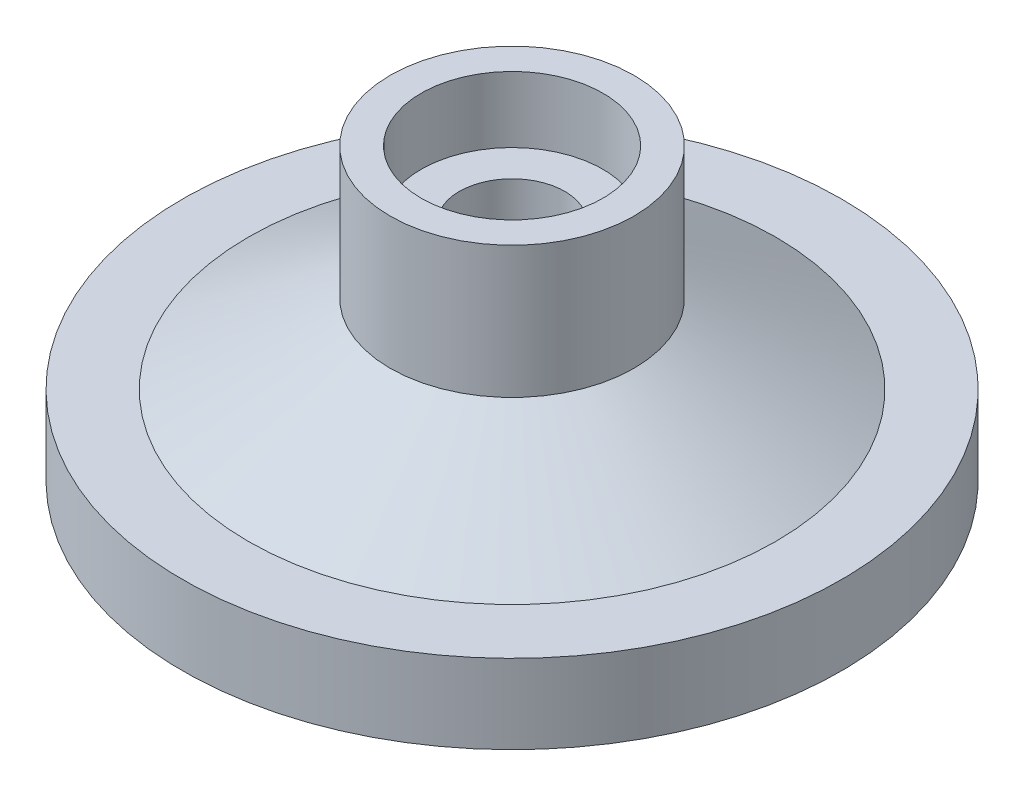
ISO-10303-21;
HEADER;
FILE_DESCRIPTION(('STEP AP214'),'2;1');
FILE_NAME('part.step','',(''),(''),'','','');
FILE_SCHEMA(('AUTOMOTIVE_DESIGN { 1 0 10303 214 1 1 1 1 }'));
ENDSEC;
DATA;
#1=APPLICATION_CONTEXT('core data for automotive mechanical design processes');
#2=APPLICATION_PROTOCOL_DEFINITION('international standard','automotive_design',2000,#1);
#3=PRODUCT_CONTEXT('',#1,'mechanical');
#4=PRODUCT('Part','Part','',(#3));
#5=PRODUCT_RELATED_PRODUCT_CATEGORY('part','',(#4));
#6=PRODUCT_DEFINITION_FORMATION('','',#4);
#7=PRODUCT_DEFINITION_CONTEXT('part definition',#1,'design');
#8=PRODUCT_DEFINITION('design','',#6,#7);
#9=PRODUCT_DEFINITION_SHAPE('','',#8);
#10=(LENGTH_UNIT() NAMED_UNIT(*) SI_UNIT(.MILLI.,.METRE.));
#11=(NAMED_UNIT(*) PLANE_ANGLE_UNIT() SI_UNIT($,.RADIAN.));
#12=(NAMED_UNIT(*) SI_UNIT($,.STERADIAN.) SOLID_ANGLE_UNIT());
#13=UNCERTAINTY_MEASURE_WITH_UNIT(LENGTH_MEASURE(1.E-05),#10,'distance_accuracy_value','');
#14=(GEOMETRIC_REPRESENTATION_CONTEXT(3) GLOBAL_UNCERTAINTY_ASSIGNED_CONTEXT((#13)) GLOBAL_UNIT_ASSIGNED_CONTEXT((#10,
#11,#12)) REPRESENTATION_CONTEXT('',''));
#15=CARTESIAN_POINT('',(0.,0.,0.));
#16=DIRECTION('',(0.,0.,1.));
#17=DIRECTION('',(1.,0.,0.));
#18=AXIS2_PLACEMENT_3D('',#15,#16,#17);
#19=CARTESIAN_POINT('',(0.,26.,0.));
#20=DIRECTION('',(0.,-1.,0.));
#21=DIRECTION('',(0.,0.,-1.));
#22=AXIS2_PLACEMENT_3D('',#19,#20,#21);
#23=CYLINDRICAL_SURFACE('',#22,4.);
#24=CARTESIAN_POINT('',(0.,6.,0.));
#25=DIRECTION('',(0.,-1.,0.));
#26=DIRECTION('',(0.,0.,-1.));
#27=AXIS2_PLACEMENT_3D('',#24,#25,#26);
#28=CIRCLE('',#27,4.);
#29=CARTESIAN_POINT('',(-3.99974418258074,6.,0.0452379697986311));
#30=VERTEX_POINT('',#29);
#31=EDGE_CURVE('E63',#30,#30,#28,.T.);
#32=ORIENTED_EDGE('',*,*,#31,.T.);
#33=EDGE_LOOP('',(#32));
#34=FACE_BOUND('',#33,.T.);
#35=CARTESIAN_POINT('',(0.,17.,0.));
#36=DIRECTION('',(0.,1.,0.));
#37=DIRECTION('',(0.,0.,1.));
#38=AXIS2_PLACEMENT_3D('',#35,#36,#37);
#39=CIRCLE('',#38,4.);
#40=CARTESIAN_POINT('',(0.,17.,4.));
#41=VERTEX_POINT('',#40);
#42=EDGE_CURVE('E42',#41,#41,#39,.F.);
#43=ORIENTED_EDGE('',*,*,#42,.F.);
#44=EDGE_LOOP('',(#43));
#45=FACE_BOUND('',#44,.T.);
#46=ADVANCED_FACE('F37',(#34,#45),#23,.F.);
#47=CARTESIAN_POINT('',(25.,0.,0.));
#48=DIRECTION('',(0.,-1.,0.));
#49=DIRECTION('',(0.,0.,-1.));
#50=AXIS2_PLACEMENT_3D('',#47,#48,#49);
#51=PLANE('',#50);
#52=CARTESIAN_POINT('',(0.,0.,0.));
#53=DIRECTION('',(0.,-1.,0.));
#54=DIRECTION('',(0.,0.,-1.));
#55=AXIS2_PLACEMENT_3D('',#52,#53,#54);
#56=CIRCLE('',#55,22.);
#57=CARTESIAN_POINT('',(0.,0.,-22.));
#58=VERTEX_POINT('',#57);
#59=EDGE_CURVE('E59',#58,#58,#56,.T.);
#60=ORIENTED_EDGE('',*,*,#59,.F.);
#61=EDGE_LOOP('',(#60));
#62=FACE_BOUND('',#61,.T.);
#63=CARTESIAN_POINT('',(0.,0.,0.));
#64=DIRECTION('',(0.,-1.,0.));
#65=DIRECTION('',(0.,0.,-1.));
#66=AXIS2_PLACEMENT_3D('',#63,#64,#65);
#67=CIRCLE('',#66,25.);
#68=CARTESIAN_POINT('',(0.,0.,-25.));
#69=VERTEX_POINT('',#68);
#70=EDGE_CURVE('E11',#69,#69,#67,.T.);
#71=ORIENTED_EDGE('',*,*,#70,.T.);
#72=EDGE_LOOP('',(#71));
#73=FACE_BOUND('',#72,.T.);
#74=ADVANCED_FACE('F39',(#62,#73),#51,.T.);
#75=CARTESIAN_POINT('',(0.,0.,0.));
#76=DIRECTION('',(0.,-1.,0.));
#77=DIRECTION('',(0.,0.,-1.));
#78=AXIS2_PLACEMENT_3D('',#75,#76,#77);
#79=CYLINDRICAL_SURFACE('',#78,25.);
#80=CARTESIAN_POINT('',(0.,6.,0.));
#81=DIRECTION('',(0.,-1.,0.));
#82=DIRECTION('',(0.,0.,-1.));
#83=AXIS2_PLACEMENT_3D('',#80,#81,#82);
#84=CIRCLE('',#83,25.);
#85=CARTESIAN_POINT('',(0.,6.,-25.));
#86=VERTEX_POINT('',#85);
#87=EDGE_CURVE('E46',#86,#86,#84,.T.);
#88=ORIENTED_EDGE('',*,*,#87,.T.);
#89=EDGE_LOOP('',(#88));
#90=FACE_BOUND('',#89,.T.);
#91=ORIENTED_EDGE('',*,*,#70,.F.);
#92=EDGE_LOOP('',(#91));
#93=FACE_BOUND('',#92,.T.);
#94=ADVANCED_FACE('F161',(#90,#93),#79,.T.);
#95=CARTESIAN_POINT('',(25.,6.,0.));
#96=DIRECTION('',(0.,1.,0.));
#97=DIRECTION('',(0.,0.,1.));
#98=AXIS2_PLACEMENT_3D('',#95,#96,#97);
#99=PLANE('',#98);
#100=CARTESIAN_POINT('',(0.,6.,0.));
#101=DIRECTION('',(0.,-1.,0.));
#102=DIRECTION('',(0.,0.,-1.));
#103=AXIS2_PLACEMENT_3D('',#100,#101,#102);
#104=CIRCLE('',#103,20.);
#105=CARTESIAN_POINT('',(0.,6.,-20.));
#106=VERTEX_POINT('',#105);
#107=EDGE_CURVE('E51',#106,#106,#104,.T.);
#108=ORIENTED_EDGE('',*,*,#107,.T.);
#109=EDGE_LOOP('',(#108));
#110=FACE_BOUND('',#109,.T.);
#111=ORIENTED_EDGE('',*,*,#87,.F.);
#112=EDGE_LOOP('',(#111));
#113=FACE_BOUND('',#112,.T.);
#114=ADVANCED_FACE('F148',(#110,#113),#99,.T.);
#115=CARTESIAN_POINT('',(0.,6.,0.));
#116=DIRECTION('',(0.,-1.,0.));
#117=DIRECTION('',(0.,0.,-1.));
#118=AXIS2_PLACEMENT_3D('',#115,#116,#117);
#119=CONICAL_SURFACE('',#118,20.,1.06172543837251);
#120=CARTESIAN_POINT('',(0.,12.,0.));
#121=DIRECTION('',(0.,-1.,0.));
#122=DIRECTION('',(0.,0.,-1.));
#123=AXIS2_PLACEMENT_3D('',#120,#121,#122);
#124=CIRCLE('',#123,9.25);
#125=CARTESIAN_POINT('',(0.,12.,-9.25));
#126=VERTEX_POINT('',#125);
#127=EDGE_CURVE('E143',#126,#126,#124,.T.);
#128=ORIENTED_EDGE('',*,*,#127,.T.);
#129=EDGE_LOOP('',(#128));
#130=FACE_BOUND('',#129,.T.);
#131=ORIENTED_EDGE('',*,*,#107,.F.);
#132=EDGE_LOOP('',(#131));
#133=FACE_BOUND('',#132,.T.);
#134=ADVANCED_FACE('F151',(#130,#133),#119,.T.);
#135=CARTESIAN_POINT('',(0.,0.,0.));
#136=DIRECTION('',(0.,-1.,0.));
#137=DIRECTION('',(0.,0.,-1.));
#138=AXIS2_PLACEMENT_3D('',#135,#136,#137);
#139=CYLINDRICAL_SURFACE('',#138,9.25);
#140=CARTESIAN_POINT('',(0.,22.,0.));
#141=DIRECTION('',(0.,-1.,0.));
#142=DIRECTION('',(0.,0.,-1.));
#143=AXIS2_PLACEMENT_3D('',#140,#141,#142);
#144=CIRCLE('',#143,9.25);
#145=CARTESIAN_POINT('',(0.,22.,-9.25));
#146=VERTEX_POINT('',#145);
#147=EDGE_CURVE('E138',#146,#146,#144,.T.);
#148=ORIENTED_EDGE('',*,*,#147,.T.);
#149=EDGE_LOOP('',(#148));
#150=FACE_BOUND('',#149,.T.);
#151=ORIENTED_EDGE('',*,*,#127,.F.);
#152=EDGE_LOOP('',(#151));
#153=FACE_BOUND('',#152,.T.);
#154=ADVANCED_FACE('F153',(#150,#153),#139,.T.);
#155=CARTESIAN_POINT('',(9.25,22.,0.));
#156=DIRECTION('',(0.,1.,0.));
#157=DIRECTION('',(0.,0.,1.));
#158=AXIS2_PLACEMENT_3D('',#155,#156,#157);
#159=PLANE('',#158);
#160=CARTESIAN_POINT('',(0.,22.,0.));
#161=DIRECTION('',(0.,1.,0.));
#162=DIRECTION('',(0.,0.,1.));
#163=AXIS2_PLACEMENT_3D('',#160,#161,#162);
#164=CIRCLE('',#163,6.9);
#165=CARTESIAN_POINT('',(0.,22.,6.9));
#166=VERTEX_POINT('',#165);
#167=EDGE_CURVE('E81',#166,#166,#164,.T.);
#168=ORIENTED_EDGE('',*,*,#167,.F.);
#169=EDGE_LOOP('',(#168));
#170=FACE_BOUND('',#169,.T.);
#171=ORIENTED_EDGE('',*,*,#147,.F.);
#172=EDGE_LOOP('',(#171));
#173=FACE_BOUND('',#172,.T.);
#174=ADVANCED_FACE('F119',(#170,#173),#159,.T.);
#175=CARTESIAN_POINT('',(0.,3.,0.));
#176=DIRECTION('',(0.,-1.,0.));
#177=DIRECTION('',(0.,0.,-1.));
#178=AXIS2_PLACEMENT_3D('',#175,#176,#177);
#179=CONICAL_SURFACE('',#178,15.,1.16590454050981);
#180=ORIENTED_EDGE('',*,*,#59,.T.);
#181=EDGE_LOOP('',(#180));
#182=FACE_BOUND('',#181,.T.);
#183=CARTESIAN_POINT('',(0.,3.,0.));
#184=DIRECTION('',(0.,-1.,0.));
#185=DIRECTION('',(0.,0.,-1.));
#186=AXIS2_PLACEMENT_3D('',#183,#184,#185);
#187=CIRCLE('',#186,15.);
#188=CARTESIAN_POINT('',(-14.2423682886658,3.,4.70690402812781));
#189=VERTEX_POINT('',#188);
#190=EDGE_CURVE('E70',#189,#189,#187,.T.);
#191=ORIENTED_EDGE('',*,*,#190,.F.);
#192=EDGE_LOOP('',(#191));
#193=FACE_BOUND('',#192,.T.);
#194=ADVANCED_FACE('F108',(#182,#193),#179,.F.);
#195=CARTESIAN_POINT('',(-3.99974418258074,6.,0.0452379697986311));
#196=CARTESIAN_POINT('',(-14.2423682886658,3.,4.70690402812781));
#197=CARTESIAN_POINT('',(-4.09022012217801,6.,-7.95425039536286));
#198=CARTESIAN_POINT('',(-23.6561763449214,3.,-23.7778325492039));
#199=CARTESIAN_POINT('',(3.90926824298349,6.,-8.04472633496012));
#200=CARTESIAN_POINT('',(4.82856023241023,3.,-33.1916406054595));
#201=CARTESIAN_POINT('',(3.99974418258074,6.,-0.0452379697986271));
#202=CARTESIAN_POINT('',(14.2423682886658,3.,-4.7069040281278));
#203=CARTESIAN_POINT('',(4.090220122178,6.,7.95425039536286));
#204=CARTESIAN_POINT('',(23.6561763449214,3.,23.7778325492039));
#205=CARTESIAN_POINT('',(-3.90926824298349,6.,8.04472633496011));
#206=CARTESIAN_POINT('',(-4.82856023241023,3.,33.1916406054595));
#207=CARTESIAN_POINT('',(-3.99974418258074,6.,0.0452379697986311));
#208=CARTESIAN_POINT('',(-14.2423682886658,3.,4.70690402812781));
#209=(BOUNDED_SURFACE() B_SPLINE_SURFACE(3,1,((#195,#196),(#197,#198),(#199,#200),(#201,#202),
(#203,#204),(#205,#206),(#207,#208)),.UNSPECIFIED.,.T.,.F.,.F.) B_SPLINE_SURFACE_WITH_KNOTS((4,
3,4),(2,2),(0.,0.5,1.),(0.,1.),
.UNSPECIFIED.) GEOMETRIC_REPRESENTATION_ITEM() RATIONAL_B_SPLINE_SURFACE(((1.,1.),
(0.333333333333333,0.333333333333333),(0.333333333333333,0.333333333333333),(1.,1.),
(0.333333333333333,0.333333333333333),(0.333333333333333,0.333333333333333),(1.,1.))) REPRESENTATION_ITEM('') SURFACE());
#210=CARTESIAN_POINT('',(-3.99974418258074,6.,0.0452379697986311));
#211=CARTESIAN_POINT('',(-4.1064381836858,5.96875,0.09379699123956));
#212=CARTESIAN_POINT('',(-4.21313218479085,5.9375,0.142356012680489));
#213=CARTESIAN_POINT('',(-4.42652018700096,5.875,0.239474055562347));
#214=CARTESIAN_POINT('',(-4.53321418810601,5.84375,0.288033077003276));
#215=CARTESIAN_POINT('',(-4.74660219031612,5.78125,0.385151119885133));
#216=CARTESIAN_POINT('',(-4.85329619142117,5.75,0.433710141326062));
#217=CARTESIAN_POINT('',(-5.06668419363127,5.6875,0.53082818420792));
#218=CARTESIAN_POINT('',(-5.17337819473633,5.65625,0.579387205648849));
#219=CARTESIAN_POINT('',(-5.38676619694643,5.59375,0.676505248530707));
#220=CARTESIAN_POINT('',(-5.49346019805149,5.5625,0.725064269971636));
#221=CARTESIAN_POINT('',(-5.70684820026159,5.5,0.822182312853493));
#222=CARTESIAN_POINT('',(-5.81354220136665,5.46875,0.870741334294422));
#223=CARTESIAN_POINT('',(-6.02693020357675,5.40625,0.96785937717628));
#224=CARTESIAN_POINT('',(-6.1336242046818,5.375,1.01641839861721));
#225=CARTESIAN_POINT('',(-6.34701220689191,5.3125,1.11353644149907));
#226=CARTESIAN_POINT('',(-6.45370620799696,5.28125,1.16209546294));
#227=CARTESIAN_POINT('',(-6.66709421020707,5.21875,1.25921350582185));
#228=CARTESIAN_POINT('',(-6.77378821131212,5.1875,1.30777252726278));
#229=CARTESIAN_POINT('',(-6.98717621352223,5.125,1.40489057014464));
#230=CARTESIAN_POINT('',(-7.09387021462728,5.09375,1.45344959158557));
#231=CARTESIAN_POINT('',(-7.30725821683739,5.03125,1.55056763446743));
#232=CARTESIAN_POINT('',(-7.41395221794244,5.,1.59912665590836));
#233=CARTESIAN_POINT('',(-7.62734022015255,4.9375,1.69624469879021));
#234=CARTESIAN_POINT('',(-7.7340342212576,4.90625,1.74480372023114));
#235=CARTESIAN_POINT('',(-7.94742222346771,4.84375,1.841921763113));
#236=CARTESIAN_POINT('',(-8.05411622457276,4.8125,1.89048078455393));
#237=CARTESIAN_POINT('',(-8.26750422678287,4.75,1.98759882743579));
#238=CARTESIAN_POINT('',(-8.37419822788792,4.71875,2.03615784887672));
#239=CARTESIAN_POINT('',(-8.58758623009803,4.65625,2.13327589175857));
#240=CARTESIAN_POINT('',(-8.69428023120308,4.625,2.1818349131995));
#241=CARTESIAN_POINT('',(-8.90766823341318,4.5625,2.27895295608136));
#242=CARTESIAN_POINT('',(-9.01436223451824,4.53125,2.32751197752229));
#243=CARTESIAN_POINT('',(-9.22775023672834,4.46875,2.42463002040415));
#244=CARTESIAN_POINT('',(-9.3344442378334,4.4375,2.47318904184508));
#245=CARTESIAN_POINT('',(-9.5478322400435,4.375,2.57030708472693));
#246=CARTESIAN_POINT('',(-9.65452624114856,4.34375,2.61886610616786));
#247=CARTESIAN_POINT('',(-9.86791424335866,4.28125,2.71598414904972));
#248=CARTESIAN_POINT('',(-9.97460824446372,4.25,2.76454317049065));
#249=CARTESIAN_POINT('',(-10.1879962466738,4.1875,2.86166121337251));
#250=CARTESIAN_POINT('',(-10.2946902477789,4.15625,2.91022023481344));
#251=CARTESIAN_POINT('',(-10.508078249989,4.09375,3.00733827769529));
#252=CARTESIAN_POINT('',(-10.614772251094,4.0625,3.05589729913622));
#253=CARTESIAN_POINT('',(-10.8281602533041,4.,3.15301534201808));
#254=CARTESIAN_POINT('',(-10.9348542544092,3.96875,3.20157436345901));
#255=CARTESIAN_POINT('',(-11.1482422566193,3.90625,3.29869240634087));
#256=CARTESIAN_POINT('',(-11.2549362577244,3.875,3.3472514277818));
#257=CARTESIAN_POINT('',(-11.4683242599345,3.8125,3.44436947066365));
#258=CARTESIAN_POINT('',(-11.5750182610395,3.78125,3.49292849210458));
#259=CARTESIAN_POINT('',(-11.7884062632496,3.71875,3.59004653498644));
#260=CARTESIAN_POINT('',(-11.8951002643547,3.6875,3.63860555642737));
#261=CARTESIAN_POINT('',(-12.1084882665648,3.625,3.73572359930923));
#262=CARTESIAN_POINT('',(-12.2151822676698,3.59375,3.78428262075016));
#263=CARTESIAN_POINT('',(-12.4285702698799,3.53125,3.88140066363201));
#264=CARTESIAN_POINT('',(-12.535264270985,3.5,3.92995968507294));
#265=CARTESIAN_POINT('',(-12.7486522731951,3.4375,4.0270777279548));
#266=CARTESIAN_POINT('',(-12.8553462743001,3.40625,4.07563674939573));
#267=CARTESIAN_POINT('',(-13.0687342765103,3.34375,4.17275479227759));
#268=CARTESIAN_POINT('',(-13.1754282776153,3.3125,4.22131381371852));
#269=CARTESIAN_POINT('',(-13.3888162798254,3.25,4.31843185660037));
#270=CARTESIAN_POINT('',(-13.4955102809305,3.21875,4.3669908780413));
#271=CARTESIAN_POINT('',(-13.7088982831406,3.15625,4.46410892092316));
#272=CARTESIAN_POINT('',(-13.8155922842456,3.125,4.51266794236409));
#273=CARTESIAN_POINT('',(-14.0289802864557,3.0625,4.60978598524595));
#274=CARTESIAN_POINT('',(-14.1356742875608,3.03125,4.65834500668688));
#275=CARTESIAN_POINT('',(-14.2423682886658,3.,4.70690402812781));
#276=B_SPLINE_CURVE_WITH_KNOTS('',3,(#210,#211,#212,#213,#214,#215,#216,#217,#218,#219,#220,
#221,#222,#223,#224,#225,#226,#227,#228,#229,#230,#231,#232,#233,#234,#235,#236,#237,#238,#239,
#240,#241,#242,#243,#244,#245,#246,#247,#248,#249,#250,#251,#252,#253,#254,#255,#256,#257,#258,
#259,#260,#261,#262,#263,#264,#265,#266,#267,#268,#269,#270,#271,#272,#273,#274,#275),
.UNSPECIFIED.,.F.,.F.,(4,2,2,2,2,2,2,2,2,2,2,2,2,2,2,2,2,2,2,2,2,2,2,2,2,2,2,2,2,2,2,2,4),(0.,
0.363955159897412,0.727910319794824,1.09186547969224,1.45582063958965,1.81977579948706,
2.18373095938447,2.54768611928189,2.9116412791793,3.27559643907671,3.63955159897412,
4.00350675887154,4.36746191876895,4.73141707866636,5.09537223856377,5.45932739846118,
5.8232825583586,6.18723771825601,6.55119287815342,6.91514803805083,7.27910319794824,
7.64305835784566,8.00701351774307,8.37096867764048,8.73492383753789,9.09887899743531,
9.46283415733272,9.82678931723013,10.1907444771275,10.554699637025,10.9186547969224,
11.2826099568198,11.6465651167172),.UNSPECIFIED.);
#277=EDGE_CURVE('BSEAM95',#30,#189,#276,.T.);
#278=ORIENTED_EDGE('',*,*,#31,.F.);
#279=ORIENTED_EDGE('',*,*,#190,.T.);
#280=ORIENTED_EDGE('',*,*,#277,.T.);
#281=ORIENTED_EDGE('',*,*,#277,.F.);
#282=EDGE_LOOP('',(#278,#280,#279,#281));
#283=FACE_BOUND('',#282,.T.);
#284=ADVANCED_FACE('F95',(#283),#209,.F.);
#285=CARTESIAN_POINT('',(0.,17.,0.));
#286=DIRECTION('',(0.,1.,0.));
#287=DIRECTION('',(0.,0.,1.));
#288=AXIS2_PLACEMENT_3D('',#285,#286,#287);
#289=PLANE('',#288);
#290=CARTESIAN_POINT('',(0.,17.,0.));
#291=DIRECTION('',(0.,1.,0.));
#292=DIRECTION('',(0.,0.,1.));
#293=AXIS2_PLACEMENT_3D('',#290,#291,#292);
#294=CIRCLE('',#293,6.9);
#295=CARTESIAN_POINT('',(0.,17.,6.9));
#296=VERTEX_POINT('',#295);
#297=EDGE_CURVE('E77',#296,#296,#294,.T.);
#298=ORIENTED_EDGE('',*,*,#297,.T.);
#299=EDGE_LOOP('',(#298));
#300=FACE_BOUND('',#299,.T.);
#301=ORIENTED_EDGE('',*,*,#42,.T.);
#302=EDGE_LOOP('',(#301));
#303=FACE_BOUND('',#302,.T.);
#304=ADVANCED_FACE('F107',(#300,#303),#289,.T.);
#305=CARTESIAN_POINT('',(0.,17.,0.));
#306=DIRECTION('',(0.,1.,0.));
#307=DIRECTION('',(0.,0.,1.));
#308=AXIS2_PLACEMENT_3D('',#305,#306,#307);
#309=CYLINDRICAL_SURFACE('',#308,6.9);
#310=ORIENTED_EDGE('',*,*,#297,.F.);
#311=EDGE_LOOP('',(#310));
#312=FACE_BOUND('',#311,.T.);
#313=ORIENTED_EDGE('',*,*,#167,.T.);
#314=EDGE_LOOP('',(#313));
#315=FACE_BOUND('',#314,.T.);
#316=ADVANCED_FACE('F227',(#312,#315),#309,.F.);
#317=CLOSED_SHELL('',(#46,#74,#94,#114,#134,#154,#174,#194,#284,#304,#316));
#318=MANIFOLD_SOLID_BREP('B2',#317);
#319=ADVANCED_BREP_SHAPE_REPRESENTATION('',(#18,#318),#14);
#320=SHAPE_DEFINITION_REPRESENTATION(#9,#319);
ENDSEC;
END-ISO-10303-21;
